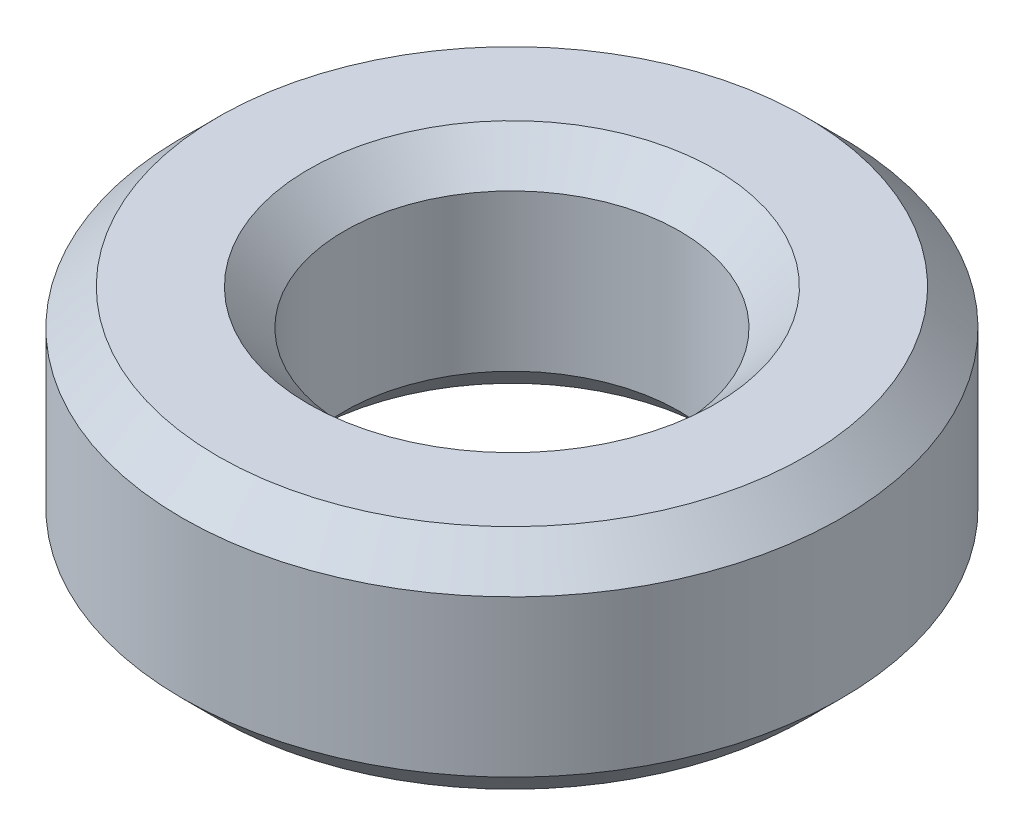
ISO-10303-21;
HEADER;
FILE_DESCRIPTION(('STEP AP214'),'2;1');
FILE_NAME('part.step','',(''),(''),'','','');
FILE_SCHEMA(('AUTOMOTIVE_DESIGN { 1 0 10303 214 1 1 1 1 }'));
ENDSEC;
DATA;
#1=APPLICATION_CONTEXT('core data for automotive mechanical design processes');
#2=APPLICATION_PROTOCOL_DEFINITION('international standard','automotive_design',2000,#1);
#3=PRODUCT_CONTEXT('',#1,'mechanical');
#4=PRODUCT('Part','Part','',(#3));
#5=PRODUCT_RELATED_PRODUCT_CATEGORY('part','',(#4));
#6=PRODUCT_DEFINITION_FORMATION('','',#4);
#7=PRODUCT_DEFINITION_CONTEXT('part definition',#1,'design');
#8=PRODUCT_DEFINITION('design','',#6,#7);
#9=PRODUCT_DEFINITION_SHAPE('','',#8);
#10=(LENGTH_UNIT() NAMED_UNIT(*) SI_UNIT(.MILLI.,.METRE.));
#11=(NAMED_UNIT(*) PLANE_ANGLE_UNIT() SI_UNIT($,.RADIAN.));
#12=(NAMED_UNIT(*) SI_UNIT($,.STERADIAN.) SOLID_ANGLE_UNIT());
#13=UNCERTAINTY_MEASURE_WITH_UNIT(LENGTH_MEASURE(1.E-05),#10,'distance_accuracy_value','');
#14=(GEOMETRIC_REPRESENTATION_CONTEXT(3) GLOBAL_UNCERTAINTY_ASSIGNED_CONTEXT((#13)) GLOBAL_UNIT_ASSIGNED_CONTEXT((#10,
#11,#12)) REPRESENTATION_CONTEXT('',''));
#15=CARTESIAN_POINT('',(0.,0.,0.));
#16=DIRECTION('',(0.,0.,1.));
#17=DIRECTION('',(1.,0.,0.));
#18=AXIS2_PLACEMENT_3D('',#15,#16,#17);
#19=CARTESIAN_POINT('',(0.,13.8017292771155,0.));
#20=DIRECTION('',(0.,-1.,0.));
#21=DIRECTION('',(0.,0.,-1.));
#22=AXIS2_PLACEMENT_3D('',#19,#20,#21);
#23=CYLINDRICAL_SURFACE('',#22,20.);
#24=CARTESIAN_POINT('',(0.,2.16302755239458,0.));
#25=DIRECTION('',(0.,1.,0.));
#26=DIRECTION('',(0.,0.,1.));
#27=AXIS2_PLACEMENT_3D('',#24,#25,#26);
#28=CIRCLE('',#27,20.);
#29=CARTESIAN_POINT('',(0.,2.16302755239458,20.));
#30=VERTEX_POINT('',#29);
#31=EDGE_CURVE('E10',#30,#30,#28,.T.);
#32=ORIENTED_EDGE('',*,*,#31,.T.);
#33=EDGE_LOOP('',(#32));
#34=FACE_BOUND('',#33,.T.);
#35=CARTESIAN_POINT('',(0.,11.6387017247209,0.));
#36=DIRECTION('',(0.,1.,0.));
#37=DIRECTION('',(0.,0.,1.));
#38=AXIS2_PLACEMENT_3D('',#35,#36,#37);
#39=CIRCLE('',#38,20.);
#40=CARTESIAN_POINT('',(0.,11.6387017247209,20.));
#41=VERTEX_POINT('',#40);
#42=EDGE_CURVE('E50',#41,#41,#39,.F.);
#43=ORIENTED_EDGE('',*,*,#42,.T.);
#44=EDGE_LOOP('',(#43));
#45=FACE_BOUND('',#44,.T.);
#46=ADVANCED_FACE('F39',(#34,#45),#23,.T.);
#47=CARTESIAN_POINT('',(0.,13.8017292771155,0.));
#48=DIRECTION('',(0.,1.,0.));
#49=DIRECTION('',(0.,0.,1.));
#50=AXIS2_PLACEMENT_3D('',#47,#48,#49);
#51=PLANE('',#50);
#52=CARTESIAN_POINT('',(0.,13.8017292771155,0.));
#53=DIRECTION('',(0.,1.,0.));
#54=DIRECTION('',(0.,0.,1.));
#55=AXIS2_PLACEMENT_3D('',#52,#53,#54);
#56=CIRCLE('',#55,12.3381656315481);
#57=CARTESIAN_POINT('',(0.,13.8017292771155,12.3381656315481));
#58=VERTEX_POINT('',#57);
#59=EDGE_CURVE('E58',#58,#58,#56,.F.);
#60=ORIENTED_EDGE('',*,*,#59,.T.);
#61=EDGE_LOOP('',(#60));
#62=FACE_BOUND('',#61,.T.);
#63=CARTESIAN_POINT('',(0.,13.8017292771155,0.));
#64=DIRECTION('',(0.,1.,0.));
#65=DIRECTION('',(0.,0.,1.));
#66=AXIS2_PLACEMENT_3D('',#63,#64,#65);
#67=CIRCLE('',#66,17.8369724476054);
#68=CARTESIAN_POINT('',(0.,13.8017292771155,17.8369724476054));
#69=VERTEX_POINT('',#68);
#70=EDGE_CURVE('E61',#69,#69,#67,.T.);
#71=ORIENTED_EDGE('',*,*,#70,.T.);
#72=EDGE_LOOP('',(#71));
#73=FACE_BOUND('',#72,.T.);
#74=ADVANCED_FACE('F88',(#62,#73),#51,.T.);
#75=CARTESIAN_POINT('',(0.,0.,0.));
#76=DIRECTION('',(0.,1.,0.));
#77=DIRECTION('',(0.,0.,1.));
#78=AXIS2_PLACEMENT_3D('',#75,#76,#77);
#79=PLANE('',#78);
#80=CARTESIAN_POINT('',(0.,0.,0.));
#81=DIRECTION('',(0.,1.,0.));
#82=DIRECTION('',(0.,0.,1.));
#83=AXIS2_PLACEMENT_3D('',#80,#81,#82);
#84=CIRCLE('',#83,12.3381656315481);
#85=CARTESIAN_POINT('',(0.,0.,12.3381656315481));
#86=VERTEX_POINT('',#85);
#87=EDGE_CURVE('E51',#86,#86,#84,.T.);
#88=ORIENTED_EDGE('',*,*,#87,.T.);
#89=EDGE_LOOP('',(#88));
#90=FACE_BOUND('',#89,.T.);
#91=CARTESIAN_POINT('',(0.,0.,0.));
#92=DIRECTION('',(0.,1.,0.));
#93=DIRECTION('',(0.,0.,1.));
#94=AXIS2_PLACEMENT_3D('',#91,#92,#93);
#95=CIRCLE('',#94,17.8369724476054);
#96=CARTESIAN_POINT('',(0.,0.,17.8369724476054));
#97=VERTEX_POINT('',#96);
#98=EDGE_CURVE('E54',#97,#97,#95,.F.);
#99=ORIENTED_EDGE('',*,*,#98,.T.);
#100=EDGE_LOOP('',(#99));
#101=FACE_BOUND('',#100,.T.);
#102=ADVANCED_FACE('F83',(#90,#101),#79,.F.);
#103=CARTESIAN_POINT('',(0.,13.8017292771155,0.));
#104=DIRECTION('',(0.,-1.,0.));
#105=DIRECTION('',(0.,0.,-1.));
#106=AXIS2_PLACEMENT_3D('',#103,#104,#105);
#107=CYLINDRICAL_SURFACE('',#106,10.1751380791535);
#108=CARTESIAN_POINT('',(0.,11.6387017247209,0.));
#109=DIRECTION('',(0.,1.,0.));
#110=DIRECTION('',(0.,0.,1.));
#111=AXIS2_PLACEMENT_3D('',#108,#109,#110);
#112=CIRCLE('',#111,10.1751380791535);
#113=CARTESIAN_POINT('',(0.,11.6387017247209,10.1751380791535));
#114=VERTEX_POINT('',#113);
#115=EDGE_CURVE('E67',#114,#114,#112,.T.);
#116=ORIENTED_EDGE('',*,*,#115,.T.);
#117=EDGE_LOOP('',(#116));
#118=FACE_BOUND('',#117,.T.);
#119=CARTESIAN_POINT('',(0.,2.16302755239461,0.));
#120=DIRECTION('',(0.,1.,0.));
#121=DIRECTION('',(0.,0.,1.));
#122=AXIS2_PLACEMENT_3D('',#119,#120,#121);
#123=CIRCLE('',#122,10.1751380791535);
#124=CARTESIAN_POINT('',(0.,2.16302755239461,10.1751380791535));
#125=VERTEX_POINT('',#124);
#126=EDGE_CURVE('E69',#125,#125,#123,.F.);
#127=ORIENTED_EDGE('',*,*,#126,.T.);
#128=EDGE_LOOP('',(#127));
#129=FACE_BOUND('',#128,.T.);
#130=ADVANCED_FACE('F71',(#118,#129),#107,.F.);
#131=CARTESIAN_POINT('',(0.,11.6387017247209,0.));
#132=DIRECTION('',(0.,1.,0.));
#133=DIRECTION('',(0.,0.,1.));
#134=AXIS2_PLACEMENT_3D('',#131,#132,#133);
#135=CONICAL_SURFACE('',#134,10.1751380791535,0.785398163397453);
#136=ORIENTED_EDGE('',*,*,#59,.F.);
#137=EDGE_LOOP('',(#136));
#138=FACE_BOUND('',#137,.T.);
#139=ORIENTED_EDGE('',*,*,#115,.F.);
#140=EDGE_LOOP('',(#139));
#141=FACE_BOUND('',#140,.T.);
#142=ADVANCED_FACE('F77',(#138,#141),#135,.F.);
#143=CARTESIAN_POINT('',(0.,0.,0.));
#144=DIRECTION('',(0.,-1.,0.));
#145=DIRECTION('',(0.,0.,-1.));
#146=AXIS2_PLACEMENT_3D('',#143,#144,#145);
#147=CONICAL_SURFACE('',#146,12.3381656315481,0.785398163397446);
#148=ORIENTED_EDGE('',*,*,#126,.F.);
#149=EDGE_LOOP('',(#148));
#150=FACE_BOUND('',#149,.T.);
#151=ORIENTED_EDGE('',*,*,#87,.F.);
#152=EDGE_LOOP('',(#151));
#153=FACE_BOUND('',#152,.T.);
#154=ADVANCED_FACE('F73',(#150,#153),#147,.F.);
#155=CARTESIAN_POINT('',(0.,2.16302755239458,0.));
#156=DIRECTION('',(0.,1.,0.));
#157=DIRECTION('',(0.,0.,1.));
#158=AXIS2_PLACEMENT_3D('',#155,#156,#157);
#159=CONICAL_SURFACE('',#158,20.,0.785398163397452);
#160=ORIENTED_EDGE('',*,*,#98,.F.);
#161=EDGE_LOOP('',(#160));
#162=FACE_BOUND('',#161,.T.);
#163=ORIENTED_EDGE('',*,*,#31,.F.);
#164=EDGE_LOOP('',(#163));
#165=FACE_BOUND('',#164,.T.);
#166=ADVANCED_FACE('F76',(#162,#165),#159,.T.);
#167=CARTESIAN_POINT('',(0.,13.8017292771155,0.));
#168=DIRECTION('',(0.,-1.,0.));
#169=DIRECTION('',(0.,0.,-1.));
#170=AXIS2_PLACEMENT_3D('',#167,#168,#169);
#171=CONICAL_SURFACE('',#170,17.8369724476054,0.785398163397445);
#172=ORIENTED_EDGE('',*,*,#42,.F.);
#173=EDGE_LOOP('',(#172));
#174=FACE_BOUND('',#173,.T.);
#175=ORIENTED_EDGE('',*,*,#70,.F.);
#176=EDGE_LOOP('',(#175));
#177=FACE_BOUND('',#176,.T.);
#178=ADVANCED_FACE('F45',(#174,#177),#171,.T.);
#179=CLOSED_SHELL('',(#46,#74,#102,#130,#142,#154,#166,#178));
#180=MANIFOLD_SOLID_BREP('B2',#179);
#181=ADVANCED_BREP_SHAPE_REPRESENTATION('',(#18,#180),#14);
#182=SHAPE_DEFINITION_REPRESENTATION(#9,#181);
ENDSEC;
END-ISO-10303-21;
